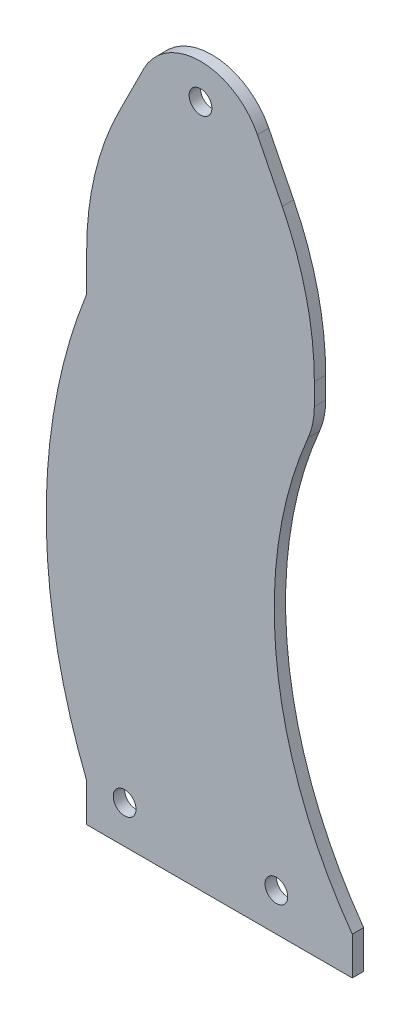
ISO-10303-21;
HEADER;
FILE_DESCRIPTION(('STEP AP214'),'2;1');
FILE_NAME('part.step','',(''),(''),'','','');
FILE_SCHEMA(('AUTOMOTIVE_DESIGN { 1 0 10303 214 1 1 1 1 }'));
ENDSEC;
DATA;
#1=APPLICATION_CONTEXT('core data for automotive mechanical design processes');
#2=APPLICATION_PROTOCOL_DEFINITION('international standard','automotive_design',2000,#1);
#3=PRODUCT_CONTEXT('',#1,'mechanical');
#4=PRODUCT('Part','Part','',(#3));
#5=PRODUCT_RELATED_PRODUCT_CATEGORY('part','',(#4));
#6=PRODUCT_DEFINITION_FORMATION('','',#4);
#7=PRODUCT_DEFINITION_CONTEXT('part definition',#1,'design');
#8=PRODUCT_DEFINITION('design','',#6,#7);
#9=PRODUCT_DEFINITION_SHAPE('','',#8);
#10=(LENGTH_UNIT() NAMED_UNIT(*) SI_UNIT(.MILLI.,.METRE.));
#11=(NAMED_UNIT(*) PLANE_ANGLE_UNIT() SI_UNIT($,.RADIAN.));
#12=(NAMED_UNIT(*) SI_UNIT($,.STERADIAN.) SOLID_ANGLE_UNIT());
#13=UNCERTAINTY_MEASURE_WITH_UNIT(LENGTH_MEASURE(1.E-05),#10,'distance_accuracy_value','');
#14=(GEOMETRIC_REPRESENTATION_CONTEXT(3) GLOBAL_UNCERTAINTY_ASSIGNED_CONTEXT((#13)) GLOBAL_UNIT_ASSIGNED_CONTEXT((#10,
#11,#12)) REPRESENTATION_CONTEXT('',''));
#15=CARTESIAN_POINT('',(0.,0.,0.));
#16=DIRECTION('',(0.,0.,1.));
#17=DIRECTION('',(1.,0.,0.));
#18=AXIS2_PLACEMENT_3D('',#15,#16,#17);
#19=CARTESIAN_POINT('',(-20.,131.114561800017,3.));
#20=DIRECTION('',(0.,0.,1.));
#21=DIRECTION('',(1.,0.,0.));
#22=AXIS2_PLACEMENT_3D('',#19,#20,#21);
#23=PLANE('',#22);
#24=CARTESIAN_POINT('',(50.,10.,3.));
#25=DIRECTION('',(0.,0.,1.));
#26=DIRECTION('',(-1.,0.,0.));
#27=AXIS2_PLACEMENT_3D('',#24,#25,#26);
#28=CIRCLE('',#27,3.);
#29=CARTESIAN_POINT('',(47.,10.,3.));
#30=VERTEX_POINT('',#29);
#31=EDGE_CURVE('E302',#30,#30,#28,.T.);
#32=ORIENTED_EDGE('',*,*,#31,.F.);
#33=EDGE_LOOP('',(#32));
#34=FACE_BOUND('',#33,.T.);
#35=CARTESIAN_POINT('',(-20.,131.114561800017,3.));
#36=DIRECTION('',(0.,0.,1.));
#37=DIRECTION('',(1.,0.,0.));
#38=AXIS2_PLACEMENT_3D('',#35,#36,#37);
#39=CIRCLE('',#38,80.);
#40=CARTESIAN_POINT('',(60.,131.114561800017,3.));
#41=VERTEX_POINT('',#40);
#42=CARTESIAN_POINT('',(51.5541752799933,166.891649440013,3.));
#43=VERTEX_POINT('',#42);
#44=EDGE_CURVE('E188',#41,#43,#39,.T.);
#45=ORIENTED_EDGE('',*,*,#44,.T.);
#46=DIRECTION('',(-0.447213595499959,0.894427190999916,0.));
#47=VECTOR('',#46,1.);
#48=CARTESIAN_POINT('',(51.5541752799933,166.891649440013,3.));
#49=LINE('',#48,#47);
#50=CARTESIAN_POINT('',(45.,180.,3.));
#51=VERTEX_POINT('',#50);
#52=EDGE_CURVE('E110',#43,#51,#49,.T.);
#53=ORIENTED_EDGE('',*,*,#52,.T.);
#54=CARTESIAN_POINT('',(30.,172.5,3.));
#55=DIRECTION('',(0.,0.,1.));
#56=DIRECTION('',(-1.,0.,0.));
#57=AXIS2_PLACEMENT_3D('',#54,#55,#56);
#58=CIRCLE('',#57,16.7705098312484);
#59=CARTESIAN_POINT('',(15.,180.,3.));
#60=VERTEX_POINT('',#59);
#61=EDGE_CURVE('E218',#51,#60,#58,.T.);
#62=ORIENTED_EDGE('',*,*,#61,.T.);
#63=DIRECTION('',(-0.447213595499958,-0.894427190999916,0.));
#64=VECTOR('',#63,1.);
#65=CARTESIAN_POINT('',(8.44582472000673,166.891649440014,3.));
#66=LINE('',#65,#64);
#67=CARTESIAN_POINT('',(8.44582472000673,166.891649440014,3.));
#68=VERTEX_POINT('',#67);
#69=EDGE_CURVE('E237',#60,#68,#66,.T.);
#70=ORIENTED_EDGE('',*,*,#69,.T.);
#71=CARTESIAN_POINT('',(80.,131.114561800017,3.));
#72=DIRECTION('',(0.,0.,1.));
#73=DIRECTION('',(-1.,0.,0.));
#74=AXIS2_PLACEMENT_3D('',#71,#72,#73);
#75=CIRCLE('',#74,80.);
#76=CARTESIAN_POINT('',(0.,131.114561800017,3.));
#77=VERTEX_POINT('',#76);
#78=EDGE_CURVE('E234',#68,#77,#75,.T.);
#79=ORIENTED_EDGE('',*,*,#78,.T.);
#80=DIRECTION('',(0.,-1.,0.));
#81=VECTOR('',#80,1.);
#82=CARTESIAN_POINT('',(0.,131.114561800017,3.));
#83=LINE('',#82,#81);
#84=CARTESIAN_POINT('',(0.,121.114561800017,3.));
#85=VERTEX_POINT('',#84);
#86=EDGE_CURVE('E236',#77,#85,#83,.T.);
#87=ORIENTED_EDGE('',*,*,#86,.T.);
#88=CARTESIAN_POINT('',(139.331936536451,65.5572809000084,3.));
#89=DIRECTION('',(0.,0.,1.));
#90=DIRECTION('',(-1.,0.,0.));
#91=AXIS2_PLACEMENT_3D('',#88,#89,#90);
#92=CIRCLE('',#91,150.);
#93=CARTESIAN_POINT('',(0.,10.,3.));
#94=VERTEX_POINT('',#93);
#95=EDGE_CURVE('E239',#85,#94,#92,.T.);
#96=ORIENTED_EDGE('',*,*,#95,.T.);
#97=DIRECTION('',(0.,-1.,0.));
#98=VECTOR('',#97,1.);
#99=CARTESIAN_POINT('',(0.,10.,3.));
#100=LINE('',#99,#98);
#101=CARTESIAN_POINT('',(0.,0.,3.));
#102=VERTEX_POINT('',#101);
#103=EDGE_CURVE('E245',#94,#102,#100,.T.);
#104=ORIENTED_EDGE('',*,*,#103,.T.);
#105=DIRECTION('',(1.,0.,0.));
#106=VECTOR('',#105,1.);
#107=CARTESIAN_POINT('',(0.,0.,3.));
#108=LINE('',#107,#106);
#109=CARTESIAN_POINT('',(70.,0.,3.));
#110=VERTEX_POINT('',#109);
#111=EDGE_CURVE('E247',#102,#110,#108,.T.);
#112=ORIENTED_EDGE('',*,*,#111,.T.);
#113=DIRECTION('',(0.,1.,0.));
#114=VECTOR('',#113,1.);
#115=CARTESIAN_POINT('',(70.,0.,3.));
#116=LINE('',#115,#114);
#117=CARTESIAN_POINT('',(70.,9.99999999999998,3.));
#118=VERTEX_POINT('',#117);
#119=EDGE_CURVE('E144',#110,#118,#116,.T.);
#120=ORIENTED_EDGE('',*,*,#119,.T.);
#121=CARTESIAN_POINT('',(159.42548401335,74.0553105447004,3.));
#122=DIRECTION('',(0.,0.,-1.));
#123=DIRECTION('',(-1.,0.,0.));
#124=AXIS2_PLACEMENT_3D('',#121,#122,#123);
#125=CIRCLE('',#124,110.);
#126=CARTESIAN_POINT('',(58.3731513866693,117.511335106395,3.));
#127=VERTEX_POINT('',#126);
#128=EDGE_CURVE('E138',#118,#127,#125,.T.);
#129=ORIENTED_EDGE('',*,*,#128,.T.);
#130=CARTESIAN_POINT('',(40.,125.412430481249,3.));
#131=DIRECTION('',(0.,0.,1.));
#132=DIRECTION('',(1.,0.,0.));
#133=AXIS2_PLACEMENT_3D('',#130,#131,#132);
#134=CIRCLE('',#133,20.);
#135=CARTESIAN_POINT('',(60.,125.412430481249,3.));
#136=VERTEX_POINT('',#135);
#137=EDGE_CURVE('E142',#127,#136,#134,.T.);
#138=ORIENTED_EDGE('',*,*,#137,.T.);
#139=DIRECTION('',(0.,1.,0.));
#140=VECTOR('',#139,1.);
#141=CARTESIAN_POINT('',(60.,131.114561800017,3.));
#142=LINE('',#141,#140);
#143=EDGE_CURVE('E52',#136,#41,#142,.T.);
#144=ORIENTED_EDGE('',*,*,#143,.T.);
#145=EDGE_LOOP('',(#45,#53,#62,#70,#79,#87,#96,#104,#112,#120,#129,#138,#144));
#146=FACE_BOUND('',#145,.T.);
#147=CARTESIAN_POINT('',(10.,10.,3.));
#148=DIRECTION('',(0.,0.,1.));
#149=DIRECTION('',(1.,0.,0.));
#150=AXIS2_PLACEMENT_3D('',#147,#148,#149);
#151=CIRCLE('',#150,3.);
#152=CARTESIAN_POINT('',(13.,10.,3.));
#153=VERTEX_POINT('',#152);
#154=EDGE_CURVE('E166',#153,#153,#151,.T.);
#155=ORIENTED_EDGE('',*,*,#154,.F.);
#156=EDGE_LOOP('',(#155));
#157=FACE_BOUND('',#156,.T.);
#158=CARTESIAN_POINT('',(30.,180.,3.));
#159=DIRECTION('',(0.,0.,1.));
#160=DIRECTION('',(1.,0.,0.));
#161=AXIS2_PLACEMENT_3D('',#158,#159,#160);
#162=CIRCLE('',#161,3.);
#163=CARTESIAN_POINT('',(33.,180.,3.));
#164=VERTEX_POINT('',#163);
#165=EDGE_CURVE('E293',#164,#164,#162,.T.);
#166=ORIENTED_EDGE('',*,*,#165,.F.);
#167=EDGE_LOOP('',(#166));
#168=FACE_BOUND('',#167,.T.);
#169=ADVANCED_FACE('F35',(#34,#146,#157,#168),#23,.T.);
#170=CARTESIAN_POINT('',(-20.,131.114561800017,0.));
#171=DIRECTION('',(0.,0.,1.));
#172=DIRECTION('',(1.,0.,0.));
#173=AXIS2_PLACEMENT_3D('',#170,#171,#172);
#174=PLANE('',#173);
#175=CARTESIAN_POINT('',(50.,10.,0.));
#176=DIRECTION('',(0.,0.,1.));
#177=DIRECTION('',(-1.,0.,0.));
#178=AXIS2_PLACEMENT_3D('',#175,#176,#177);
#179=CIRCLE('',#178,3.);
#180=CARTESIAN_POINT('',(47.,10.,0.));
#181=VERTEX_POINT('',#180);
#182=EDGE_CURVE('E299',#181,#181,#179,.T.);
#183=ORIENTED_EDGE('',*,*,#182,.T.);
#184=EDGE_LOOP('',(#183));
#185=FACE_BOUND('',#184,.T.);
#186=CARTESIAN_POINT('',(-20.,131.114561800017,0.));
#187=DIRECTION('',(0.,0.,1.));
#188=DIRECTION('',(1.,0.,0.));
#189=AXIS2_PLACEMENT_3D('',#186,#187,#188);
#190=CIRCLE('',#189,80.);
#191=CARTESIAN_POINT('',(60.,131.114561800017,0.));
#192=VERTEX_POINT('',#191);
#193=CARTESIAN_POINT('',(51.5541752799933,166.891649440013,0.));
#194=VERTEX_POINT('',#193);
#195=EDGE_CURVE('E162',#192,#194,#190,.T.);
#196=ORIENTED_EDGE('',*,*,#195,.F.);
#197=DIRECTION('',(0.,1.,0.));
#198=VECTOR('',#197,1.);
#199=CARTESIAN_POINT('',(60.,131.114561800017,0.));
#200=LINE('',#199,#198);
#201=CARTESIAN_POINT('',(60.,125.412430481249,0.));
#202=VERTEX_POINT('',#201);
#203=EDGE_CURVE('E102',#202,#192,#200,.T.);
#204=ORIENTED_EDGE('',*,*,#203,.F.);
#205=CARTESIAN_POINT('',(40.,125.412430481249,0.));
#206=DIRECTION('',(0.,0.,1.));
#207=DIRECTION('',(1.,0.,0.));
#208=AXIS2_PLACEMENT_3D('',#205,#206,#207);
#209=CIRCLE('',#208,20.);
#210=CARTESIAN_POINT('',(58.3731513866693,117.511335106395,0.));
#211=VERTEX_POINT('',#210);
#212=EDGE_CURVE('E96',#211,#202,#209,.T.);
#213=ORIENTED_EDGE('',*,*,#212,.F.);
#214=CARTESIAN_POINT('',(159.42548401335,74.0553105447004,0.));
#215=DIRECTION('',(0.,0.,-1.));
#216=DIRECTION('',(-1.,0.,0.));
#217=AXIS2_PLACEMENT_3D('',#214,#215,#216);
#218=CIRCLE('',#217,110.);
#219=CARTESIAN_POINT('',(70.,9.99999999999998,0.));
#220=VERTEX_POINT('',#219);
#221=EDGE_CURVE('E152',#220,#211,#218,.T.);
#222=ORIENTED_EDGE('',*,*,#221,.F.);
#223=DIRECTION('',(0.,1.,0.));
#224=VECTOR('',#223,1.);
#225=CARTESIAN_POINT('',(70.,0.,0.));
#226=LINE('',#225,#224);
#227=CARTESIAN_POINT('',(70.,0.,0.));
#228=VERTEX_POINT('',#227);
#229=EDGE_CURVE('E183',#228,#220,#226,.T.);
#230=ORIENTED_EDGE('',*,*,#229,.F.);
#231=DIRECTION('',(1.,0.,0.));
#232=VECTOR('',#231,1.);
#233=CARTESIAN_POINT('',(60.,0.,0.));
#234=LINE('',#233,#232);
#235=CARTESIAN_POINT('',(0.,0.,0.));
#236=VERTEX_POINT('',#235);
#237=EDGE_CURVE('E181',#236,#228,#234,.T.);
#238=ORIENTED_EDGE('',*,*,#237,.F.);
#239=DIRECTION('',(0.,-1.,0.));
#240=VECTOR('',#239,1.);
#241=CARTESIAN_POINT('',(0.,10.,0.));
#242=LINE('',#241,#240);
#243=CARTESIAN_POINT('',(0.,10.,0.));
#244=VERTEX_POINT('',#243);
#245=EDGE_CURVE('E178',#244,#236,#242,.T.);
#246=ORIENTED_EDGE('',*,*,#245,.F.);
#247=CARTESIAN_POINT('',(139.331936536451,65.5572809000084,0.));
#248=DIRECTION('',(0.,0.,1.));
#249=DIRECTION('',(-1.,0.,0.));
#250=AXIS2_PLACEMENT_3D('',#247,#248,#249);
#251=CIRCLE('',#250,150.);
#252=CARTESIAN_POINT('',(0.,121.114561800017,0.));
#253=VERTEX_POINT('',#252);
#254=EDGE_CURVE('E176',#253,#244,#251,.T.);
#255=ORIENTED_EDGE('',*,*,#254,.F.);
#256=DIRECTION('',(0.,-1.,0.));
#257=VECTOR('',#256,1.);
#258=CARTESIAN_POINT('',(0.,131.114561800017,0.));
#259=LINE('',#258,#257);
#260=CARTESIAN_POINT('',(0.,131.114561800017,0.));
#261=VERTEX_POINT('',#260);
#262=EDGE_CURVE('E174',#261,#253,#259,.T.);
#263=ORIENTED_EDGE('',*,*,#262,.F.);
#264=CARTESIAN_POINT('',(80.,131.114561800017,0.));
#265=DIRECTION('',(0.,0.,1.));
#266=DIRECTION('',(-1.,0.,0.));
#267=AXIS2_PLACEMENT_3D('',#264,#265,#266);
#268=CIRCLE('',#267,80.);
#269=CARTESIAN_POINT('',(8.44582472000673,166.891649440014,0.));
#270=VERTEX_POINT('',#269);
#271=EDGE_CURVE('E172',#270,#261,#268,.T.);
#272=ORIENTED_EDGE('',*,*,#271,.F.);
#273=DIRECTION('',(-0.447213595499958,-0.894427190999916,0.));
#274=VECTOR('',#273,1.);
#275=CARTESIAN_POINT('',(8.44582472000673,166.891649440014,0.));
#276=LINE('',#275,#274);
#277=CARTESIAN_POINT('',(15.,180.,0.));
#278=VERTEX_POINT('',#277);
#279=EDGE_CURVE('E170',#278,#270,#276,.T.);
#280=ORIENTED_EDGE('',*,*,#279,.F.);
#281=CARTESIAN_POINT('',(30.,172.5,0.));
#282=DIRECTION('',(0.,0.,1.));
#283=DIRECTION('',(-1.,0.,0.));
#284=AXIS2_PLACEMENT_3D('',#281,#282,#283);
#285=CIRCLE('',#284,16.7705098312484);
#286=CARTESIAN_POINT('',(45.,180.,0.));
#287=VERTEX_POINT('',#286);
#288=EDGE_CURVE('E168',#287,#278,#285,.T.);
#289=ORIENTED_EDGE('',*,*,#288,.F.);
#290=DIRECTION('',(-0.447213595499959,0.894427190999916,0.));
#291=VECTOR('',#290,1.);
#292=CARTESIAN_POINT('',(51.5541752799933,166.891649440013,0.));
#293=LINE('',#292,#291);
#294=EDGE_CURVE('E165',#194,#287,#293,.T.);
#295=ORIENTED_EDGE('',*,*,#294,.F.);
#296=EDGE_LOOP('',(#196,#204,#213,#222,#230,#238,#246,#255,#263,#272,#280,#289,#295));
#297=FACE_BOUND('',#296,.T.);
#298=CARTESIAN_POINT('',(10.,10.,0.));
#299=DIRECTION('',(0.,0.,1.));
#300=DIRECTION('',(1.,0.,0.));
#301=AXIS2_PLACEMENT_3D('',#298,#299,#300);
#302=CIRCLE('',#301,3.);
#303=CARTESIAN_POINT('',(13.,10.,0.));
#304=VERTEX_POINT('',#303);
#305=EDGE_CURVE('E305',#304,#304,#302,.T.);
#306=ORIENTED_EDGE('',*,*,#305,.T.);
#307=EDGE_LOOP('',(#306));
#308=FACE_BOUND('',#307,.T.);
#309=CARTESIAN_POINT('',(30.,180.,0.));
#310=DIRECTION('',(0.,0.,1.));
#311=DIRECTION('',(1.,0.,0.));
#312=AXIS2_PLACEMENT_3D('',#309,#310,#311);
#313=CIRCLE('',#312,3.);
#314=CARTESIAN_POINT('',(33.,180.,0.));
#315=VERTEX_POINT('',#314);
#316=EDGE_CURVE('E296',#315,#315,#313,.T.);
#317=ORIENTED_EDGE('',*,*,#316,.T.);
#318=EDGE_LOOP('',(#317));
#319=FACE_BOUND('',#318,.T.);
#320=ADVANCED_FACE('F222',(#185,#297,#308,#319),#174,.F.);
#321=CARTESIAN_POINT('',(-20.,131.114561800017,3.));
#322=DIRECTION('',(0.,0.,-1.));
#323=DIRECTION('',(-1.,0.,0.));
#324=AXIS2_PLACEMENT_3D('',#321,#322,#323);
#325=CYLINDRICAL_SURFACE('',#324,80.);
#326=ORIENTED_EDGE('',*,*,#195,.T.);
#327=DIRECTION('',(0.,0.,-1.));
#328=VECTOR('',#327,1.);
#329=CARTESIAN_POINT('',(51.5541752799933,166.891649440013,3.));
#330=LINE('',#329,#328);
#331=EDGE_CURVE('E11',#43,#194,#330,.T.);
#332=ORIENTED_EDGE('',*,*,#331,.F.);
#333=ORIENTED_EDGE('',*,*,#44,.F.);
#334=DIRECTION('',(0.,0.,-1.));
#335=VECTOR('',#334,1.);
#336=CARTESIAN_POINT('',(60.,131.114561800017,3.));
#337=LINE('',#336,#335);
#338=EDGE_CURVE('E158',#41,#192,#337,.T.);
#339=ORIENTED_EDGE('',*,*,#338,.T.);
#340=EDGE_LOOP('',(#326,#332,#333,#339));
#341=FACE_BOUND('',#340,.T.);
#342=ADVANCED_FACE('F37',(#341),#325,.T.);
#343=CARTESIAN_POINT('',(51.5541752799933,166.891649440013,3.));
#344=DIRECTION('',(-0.894427190999916,-0.447213595499959,0.));
#345=DIRECTION('',(0.447213595499959,-0.894427190999916,0.));
#346=AXIS2_PLACEMENT_3D('',#343,#344,#345);
#347=PLANE('',#346);
#348=ORIENTED_EDGE('',*,*,#294,.T.);
#349=DIRECTION('',(0.,0.,-1.));
#350=VECTOR('',#349,1.);
#351=CARTESIAN_POINT('',(45.,180.,3.));
#352=LINE('',#351,#350);
#353=EDGE_CURVE('E44',#51,#287,#352,.T.);
#354=ORIENTED_EDGE('',*,*,#353,.F.);
#355=ORIENTED_EDGE('',*,*,#52,.F.);
#356=ORIENTED_EDGE('',*,*,#331,.T.);
#357=EDGE_LOOP('',(#348,#354,#355,#356));
#358=FACE_BOUND('',#357,.T.);
#359=ADVANCED_FACE('F417',(#358),#347,.F.);
#360=CARTESIAN_POINT('',(30.,172.5,3.));
#361=DIRECTION('',(0.,0.,-1.));
#362=DIRECTION('',(-1.,0.,0.));
#363=AXIS2_PLACEMENT_3D('',#360,#361,#362);
#364=CYLINDRICAL_SURFACE('',#363,16.7705098312484);
#365=ORIENTED_EDGE('',*,*,#288,.T.);
#366=DIRECTION('',(0.,0.,-1.));
#367=VECTOR('',#366,1.);
#368=CARTESIAN_POINT('',(15.,180.,3.));
#369=LINE('',#368,#367);
#370=EDGE_CURVE('E210',#60,#278,#369,.T.);
#371=ORIENTED_EDGE('',*,*,#370,.F.);
#372=ORIENTED_EDGE('',*,*,#61,.F.);
#373=ORIENTED_EDGE('',*,*,#353,.T.);
#374=EDGE_LOOP('',(#365,#371,#372,#373));
#375=FACE_BOUND('',#374,.T.);
#376=ADVANCED_FACE('F216',(#375),#364,.T.);
#377=CARTESIAN_POINT('',(8.44582472000673,166.891649440014,3.));
#378=DIRECTION('',(0.894427190999916,-0.447213595499958,0.));
#379=DIRECTION('',(0.447213595499958,0.894427190999916,0.));
#380=AXIS2_PLACEMENT_3D('',#377,#378,#379);
#381=PLANE('',#380);
#382=ORIENTED_EDGE('',*,*,#279,.T.);
#383=DIRECTION('',(0.,0.,-1.));
#384=VECTOR('',#383,1.);
#385=CARTESIAN_POINT('',(8.44582472000673,166.891649440014,3.));
#386=LINE('',#385,#384);
#387=EDGE_CURVE('E207',#68,#270,#386,.T.);
#388=ORIENTED_EDGE('',*,*,#387,.F.);
#389=ORIENTED_EDGE('',*,*,#69,.F.);
#390=ORIENTED_EDGE('',*,*,#370,.T.);
#391=EDGE_LOOP('',(#382,#388,#389,#390));
#392=FACE_BOUND('',#391,.T.);
#393=ADVANCED_FACE('F228',(#392),#381,.F.);
#394=CARTESIAN_POINT('',(80.,131.114561800017,3.));
#395=DIRECTION('',(0.,0.,-1.));
#396=DIRECTION('',(-1.,0.,0.));
#397=AXIS2_PLACEMENT_3D('',#394,#395,#396);
#398=CYLINDRICAL_SURFACE('',#397,80.);
#399=ORIENTED_EDGE('',*,*,#271,.T.);
#400=DIRECTION('',(0.,0.,-1.));
#401=VECTOR('',#400,1.);
#402=CARTESIAN_POINT('',(0.,131.114561800017,3.));
#403=LINE('',#402,#401);
#404=EDGE_CURVE('E204',#77,#261,#403,.T.);
#405=ORIENTED_EDGE('',*,*,#404,.F.);
#406=ORIENTED_EDGE('',*,*,#78,.F.);
#407=ORIENTED_EDGE('',*,*,#387,.T.);
#408=EDGE_LOOP('',(#399,#405,#406,#407));
#409=FACE_BOUND('',#408,.T.);
#410=ADVANCED_FACE('F232',(#409),#398,.T.);
#411=CARTESIAN_POINT('',(0.,131.114561800017,3.));
#412=DIRECTION('',(1.,0.,0.));
#413=DIRECTION('',(0.,1.,0.));
#414=AXIS2_PLACEMENT_3D('',#411,#412,#413);
#415=PLANE('',#414);
#416=ORIENTED_EDGE('',*,*,#262,.T.);
#417=DIRECTION('',(0.,0.,-1.));
#418=VECTOR('',#417,1.);
#419=CARTESIAN_POINT('',(0.,121.114561800017,3.));
#420=LINE('',#419,#418);
#421=EDGE_CURVE('E201',#85,#253,#420,.T.);
#422=ORIENTED_EDGE('',*,*,#421,.F.);
#423=ORIENTED_EDGE('',*,*,#86,.F.);
#424=ORIENTED_EDGE('',*,*,#404,.T.);
#425=EDGE_LOOP('',(#416,#422,#423,#424));
#426=FACE_BOUND('',#425,.T.);
#427=ADVANCED_FACE('F382',(#426),#415,.F.);
#428=CARTESIAN_POINT('',(139.331936536451,65.5572809000084,3.));
#429=DIRECTION('',(0.,0.,-1.));
#430=DIRECTION('',(-1.,0.,0.));
#431=AXIS2_PLACEMENT_3D('',#428,#429,#430);
#432=CYLINDRICAL_SURFACE('',#431,150.);
#433=ORIENTED_EDGE('',*,*,#254,.T.);
#434=DIRECTION('',(0.,0.,-1.));
#435=VECTOR('',#434,1.);
#436=CARTESIAN_POINT('',(0.,10.,3.));
#437=LINE('',#436,#435);
#438=EDGE_CURVE('E198',#94,#244,#437,.T.);
#439=ORIENTED_EDGE('',*,*,#438,.F.);
#440=ORIENTED_EDGE('',*,*,#95,.F.);
#441=ORIENTED_EDGE('',*,*,#421,.T.);
#442=EDGE_LOOP('',(#433,#439,#440,#441));
#443=FACE_BOUND('',#442,.T.);
#444=ADVANCED_FACE('F372',(#443),#432,.T.);
#445=CARTESIAN_POINT('',(0.,10.,3.));
#446=DIRECTION('',(1.,0.,0.));
#447=DIRECTION('',(0.,1.,0.));
#448=AXIS2_PLACEMENT_3D('',#445,#446,#447);
#449=PLANE('',#448);
#450=ORIENTED_EDGE('',*,*,#245,.T.);
#451=DIRECTION('',(0.,0.,-1.));
#452=VECTOR('',#451,1.);
#453=CARTESIAN_POINT('',(0.,0.,3.));
#454=LINE('',#453,#452);
#455=EDGE_CURVE('E195',#102,#236,#454,.T.);
#456=ORIENTED_EDGE('',*,*,#455,.F.);
#457=ORIENTED_EDGE('',*,*,#103,.F.);
#458=ORIENTED_EDGE('',*,*,#438,.T.);
#459=EDGE_LOOP('',(#450,#456,#457,#458));
#460=FACE_BOUND('',#459,.T.);
#461=ADVANCED_FACE('F362',(#460),#449,.F.);
#462=CARTESIAN_POINT('',(60.,0.,3.));
#463=DIRECTION('',(0.,1.,0.));
#464=DIRECTION('',(0.,0.,1.));
#465=AXIS2_PLACEMENT_3D('',#462,#463,#464);
#466=PLANE('',#465);
#467=ORIENTED_EDGE('',*,*,#237,.T.);
#468=DIRECTION('',(0.,0.,-1.));
#469=VECTOR('',#468,1.);
#470=CARTESIAN_POINT('',(70.,0.,3.));
#471=LINE('',#470,#469);
#472=EDGE_CURVE('E192',#110,#228,#471,.T.);
#473=ORIENTED_EDGE('',*,*,#472,.F.);
#474=ORIENTED_EDGE('',*,*,#111,.F.);
#475=ORIENTED_EDGE('',*,*,#455,.T.);
#476=EDGE_LOOP('',(#467,#473,#474,#475));
#477=FACE_BOUND('',#476,.T.);
#478=ADVANCED_FACE('F253',(#477),#466,.F.);
#479=CARTESIAN_POINT('',(70.,0.,3.));
#480=DIRECTION('',(-1.,0.,0.));
#481=DIRECTION('',(0.,0.,1.));
#482=AXIS2_PLACEMENT_3D('',#479,#480,#481);
#483=PLANE('',#482);
#484=ORIENTED_EDGE('',*,*,#229,.T.);
#485=DIRECTION('',(0.,0.,-1.));
#486=VECTOR('',#485,1.);
#487=CARTESIAN_POINT('',(70.,9.99999999999998,3.));
#488=LINE('',#487,#486);
#489=EDGE_CURVE('E153',#118,#220,#488,.T.);
#490=ORIENTED_EDGE('',*,*,#489,.F.);
#491=ORIENTED_EDGE('',*,*,#119,.F.);
#492=ORIENTED_EDGE('',*,*,#472,.T.);
#493=EDGE_LOOP('',(#484,#490,#491,#492));
#494=FACE_BOUND('',#493,.T.);
#495=ADVANCED_FACE('F256',(#494),#483,.F.);
#496=CARTESIAN_POINT('',(159.42548401335,74.0553105447004,3.));
#497=DIRECTION('',(0.,0.,-1.));
#498=DIRECTION('',(-1.,0.,0.));
#499=AXIS2_PLACEMENT_3D('',#496,#497,#498);
#500=CYLINDRICAL_SURFACE('',#499,110.);
#501=ORIENTED_EDGE('',*,*,#221,.T.);
#502=DIRECTION('',(0.,0.,-1.));
#503=VECTOR('',#502,1.);
#504=CARTESIAN_POINT('',(58.3731513866693,117.511335106395,3.));
#505=LINE('',#504,#503);
#506=EDGE_CURVE('E149',#127,#211,#505,.T.);
#507=ORIENTED_EDGE('',*,*,#506,.F.);
#508=ORIENTED_EDGE('',*,*,#128,.F.);
#509=ORIENTED_EDGE('',*,*,#489,.T.);
#510=EDGE_LOOP('',(#501,#507,#508,#509));
#511=FACE_BOUND('',#510,.T.);
#512=ADVANCED_FACE('F150',(#511),#500,.F.);
#513=CARTESIAN_POINT('',(40.,125.412430481249,3.));
#514=DIRECTION('',(0.,0.,-1.));
#515=DIRECTION('',(-1.,0.,0.));
#516=AXIS2_PLACEMENT_3D('',#513,#514,#515);
#517=CYLINDRICAL_SURFACE('',#516,20.);
#518=ORIENTED_EDGE('',*,*,#212,.T.);
#519=DIRECTION('',(0.,0.,-1.));
#520=VECTOR('',#519,1.);
#521=CARTESIAN_POINT('',(60.,125.412430481249,3.));
#522=LINE('',#521,#520);
#523=EDGE_CURVE('E154',#136,#202,#522,.T.);
#524=ORIENTED_EDGE('',*,*,#523,.F.);
#525=ORIENTED_EDGE('',*,*,#137,.F.);
#526=ORIENTED_EDGE('',*,*,#506,.T.);
#527=EDGE_LOOP('',(#518,#524,#525,#526));
#528=FACE_BOUND('',#527,.T.);
#529=ADVANCED_FACE('F156',(#528),#517,.T.);
#530=CARTESIAN_POINT('',(60.,131.114561800017,3.));
#531=DIRECTION('',(-1.,0.,0.));
#532=DIRECTION('',(0.,0.,1.));
#533=AXIS2_PLACEMENT_3D('',#530,#531,#532);
#534=PLANE('',#533);
#535=ORIENTED_EDGE('',*,*,#203,.T.);
#536=ORIENTED_EDGE('',*,*,#338,.F.);
#537=ORIENTED_EDGE('',*,*,#143,.F.);
#538=ORIENTED_EDGE('',*,*,#523,.T.);
#539=EDGE_LOOP('',(#535,#536,#537,#538));
#540=FACE_BOUND('',#539,.T.);
#541=ADVANCED_FACE('F260',(#540),#534,.F.);
#542=CARTESIAN_POINT('',(10.,10.,3.));
#543=DIRECTION('',(0.,0.,-1.));
#544=DIRECTION('',(-1.,0.,0.));
#545=AXIS2_PLACEMENT_3D('',#542,#543,#544);
#546=CYLINDRICAL_SURFACE('',#545,3.);
#547=ORIENTED_EDGE('',*,*,#154,.T.);
#548=EDGE_LOOP('',(#547));
#549=FACE_BOUND('',#548,.T.);
#550=ORIENTED_EDGE('',*,*,#305,.F.);
#551=EDGE_LOOP('',(#550));
#552=FACE_BOUND('',#551,.T.);
#553=ADVANCED_FACE('F262',(#549,#552),#546,.F.);
#554=CARTESIAN_POINT('',(50.,10.,3.));
#555=DIRECTION('',(0.,0.,-1.));
#556=DIRECTION('',(-1.,0.,0.));
#557=AXIS2_PLACEMENT_3D('',#554,#555,#556);
#558=CYLINDRICAL_SURFACE('',#557,3.);
#559=ORIENTED_EDGE('',*,*,#31,.T.);
#560=EDGE_LOOP('',(#559));
#561=FACE_BOUND('',#560,.T.);
#562=ORIENTED_EDGE('',*,*,#182,.F.);
#563=EDGE_LOOP('',(#562));
#564=FACE_BOUND('',#563,.T.);
#565=ADVANCED_FACE('F268',(#561,#564),#558,.F.);
#566=CARTESIAN_POINT('',(30.,180.,3.));
#567=DIRECTION('',(0.,0.,-1.));
#568=DIRECTION('',(-1.,0.,0.));
#569=AXIS2_PLACEMENT_3D('',#566,#567,#568);
#570=CYLINDRICAL_SURFACE('',#569,3.);
#571=ORIENTED_EDGE('',*,*,#165,.T.);
#572=EDGE_LOOP('',(#571));
#573=FACE_BOUND('',#572,.T.);
#574=ORIENTED_EDGE('',*,*,#316,.F.);
#575=EDGE_LOOP('',(#574));
#576=FACE_BOUND('',#575,.T.);
#577=ADVANCED_FACE('F284',(#573,#576),#570,.F.);
#578=CLOSED_SHELL('',(#169,#320,#342,#359,#376,#393,#410,#427,#444,#461,#478,#495,#512,#529,
#541,#553,#565,#577));
#579=MANIFOLD_SOLID_BREP('B2',#578);
#580=ADVANCED_BREP_SHAPE_REPRESENTATION('',(#18,#579),#14);
#581=SHAPE_DEFINITION_REPRESENTATION(#9,#580);
ENDSEC;
END-ISO-10303-21;
